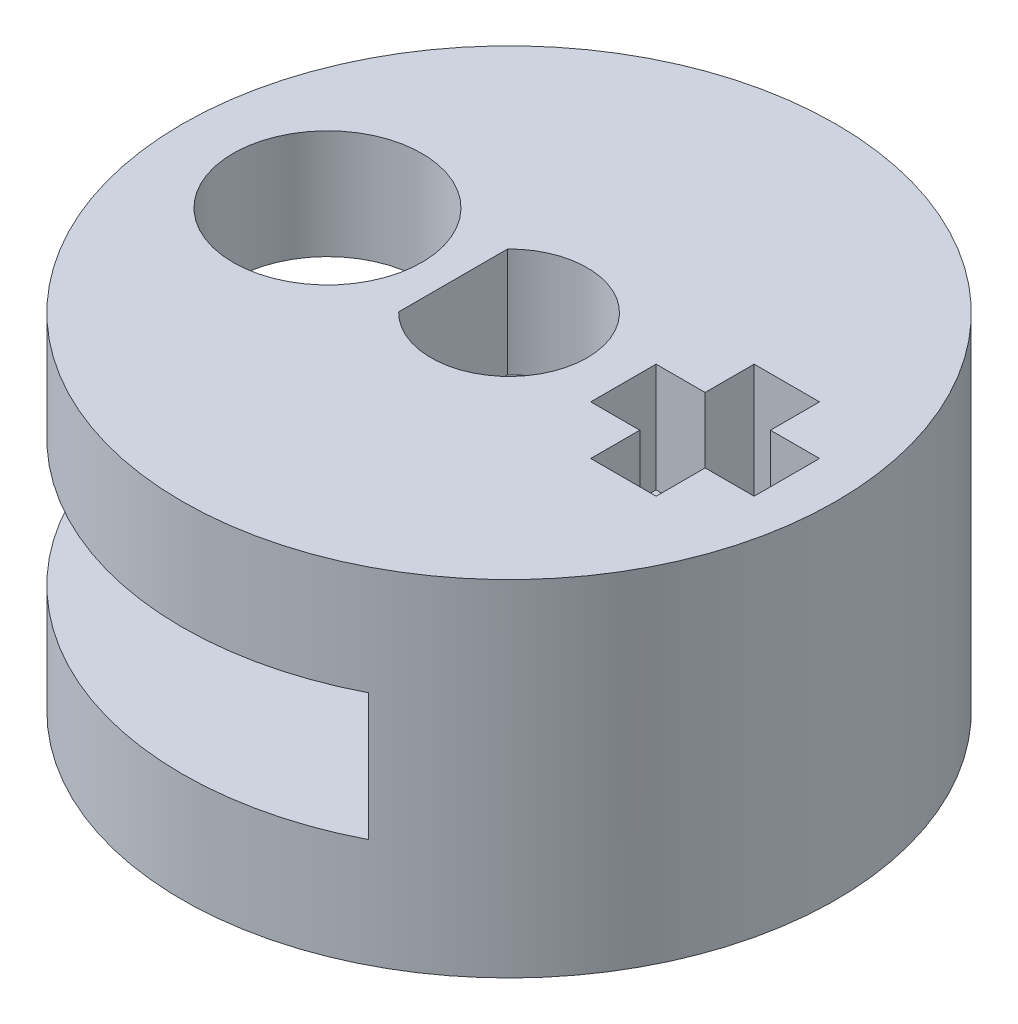
ISO-10303-21;
HEADER;
FILE_DESCRIPTION(('STEP AP214'),'2;1');
FILE_NAME('part.step','',(''),(''),'','','');
FILE_SCHEMA(('AUTOMOTIVE_DESIGN { 1 0 10303 214 1 1 1 1 }'));
ENDSEC;
DATA;
#1=APPLICATION_CONTEXT('core data for automotive mechanical design processes');
#2=APPLICATION_PROTOCOL_DEFINITION('international standard','automotive_design',2000,#1);
#3=PRODUCT_CONTEXT('',#1,'mechanical');
#4=PRODUCT('Part','Part','',(#3));
#5=PRODUCT_RELATED_PRODUCT_CATEGORY('part','',(#4));
#6=PRODUCT_DEFINITION_FORMATION('','',#4);
#7=PRODUCT_DEFINITION_CONTEXT('part definition',#1,'design');
#8=PRODUCT_DEFINITION('design','',#6,#7);
#9=PRODUCT_DEFINITION_SHAPE('','',#8);
#10=(LENGTH_UNIT() NAMED_UNIT(*) SI_UNIT(.MILLI.,.METRE.));
#11=(NAMED_UNIT(*) PLANE_ANGLE_UNIT() SI_UNIT($,.RADIAN.));
#12=(NAMED_UNIT(*) SI_UNIT($,.STERADIAN.) SOLID_ANGLE_UNIT());
#13=UNCERTAINTY_MEASURE_WITH_UNIT(LENGTH_MEASURE(1.E-05),#10,'distance_accuracy_value','');
#14=(GEOMETRIC_REPRESENTATION_CONTEXT(3) GLOBAL_UNCERTAINTY_ASSIGNED_CONTEXT((#13)) GLOBAL_UNIT_ASSIGNED_CONTEXT((#10,
#11,#12)) REPRESENTATION_CONTEXT('',''));
#15=CARTESIAN_POINT('',(0.,0.,0.));
#16=DIRECTION('',(0.,0.,1.));
#17=DIRECTION('',(1.,0.,0.));
#18=AXIS2_PLACEMENT_3D('',#15,#16,#17);
#19=CARTESIAN_POINT('',(4.12310562561766,-3.5,8.));
#20=DIRECTION('',(1.,0.,0.));
#21=DIRECTION('',(0.,0.,-1.));
#22=AXIS2_PLACEMENT_3D('',#19,#20,#21);
#23=PLANE('',#22);
#24=DIRECTION('',(0.,0.,-1.));
#25=VECTOR('',#24,1.);
#26=CARTESIAN_POINT('',(4.12310562561766,-3.5,8.));
#27=LINE('',#26,#25);
#28=CARTESIAN_POINT('',(4.12310562561766,-3.5,-0.798435283416333));
#29=VERTEX_POINT('',#28);
#30=CARTESIAN_POINT('',(4.12310562561766,-3.5,-8.));
#31=VERTEX_POINT('',#30);
#32=EDGE_CURVE('E329',#29,#31,#27,.T.);
#33=ORIENTED_EDGE('',*,*,#32,.F.);
#34=DIRECTION('',(0.,1.,0.));
#35=VECTOR('',#34,1.);
#36=CARTESIAN_POINT('',(4.12310562561766,-3.5,-0.798435283416334));
#37=LINE('',#36,#35);
#38=CARTESIAN_POINT('',(4.12310562561766,0.,-0.798435283416334));
#39=VERTEX_POINT('',#38);
#40=EDGE_CURVE('E299',#29,#39,#37,.T.);
#41=ORIENTED_EDGE('',*,*,#40,.T.);
#42=DIRECTION('',(0.,0.,-1.));
#43=VECTOR('',#42,1.);
#44=CARTESIAN_POINT('',(4.12310562561766,0.,8.));
#45=LINE('',#44,#43);
#46=CARTESIAN_POINT('',(4.12310562561766,0.,-8.));
#47=VERTEX_POINT('',#46);
#48=EDGE_CURVE('E320',#39,#47,#45,.T.);
#49=ORIENTED_EDGE('',*,*,#48,.T.);
#50=DIRECTION('',(0.,1.,0.));
#51=VECTOR('',#50,1.);
#52=CARTESIAN_POINT('',(4.12310562561766,-3.5,-8.));
#53=LINE('',#52,#51);
#54=EDGE_CURVE('E328',#31,#47,#53,.T.);
#55=ORIENTED_EDGE('',*,*,#54,.F.);
#56=EDGE_LOOP('',(#33,#41,#49,#55));
#57=FACE_BOUND('',#56,.T.);
#58=ADVANCED_FACE('F44',(#57),#23,.F.);
#59=CARTESIAN_POINT('',(0.,0.,0.));
#60=DIRECTION('',(0.,1.,0.));
#61=DIRECTION('',(0.,0.,1.));
#62=AXIS2_PLACEMENT_3D('',#59,#60,#61);
#63=PLANE('',#62);
#64=ORIENTED_EDGE('',*,*,#48,.F.);
#65=DIRECTION('',(-1.,0.,0.));
#66=VECTOR('',#65,1.);
#67=CARTESIAN_POINT('',(0.,0.,-0.798435283416332));
#68=LINE('',#67,#66);
#69=CARTESIAN_POINT('',(3.25,0.,-0.798435283416333));
#70=VERTEX_POINT('',#69);
#71=EDGE_CURVE('E303',#39,#70,#68,.T.);
#72=ORIENTED_EDGE('',*,*,#71,.T.);
#73=DIRECTION('',(0.,0.,1.));
#74=VECTOR('',#73,1.);
#75=CARTESIAN_POINT('',(3.25,0.,0.));
#76=LINE('',#75,#74);
#77=CARTESIAN_POINT('',(3.25,0.,1.00156471658367));
#78=VERTEX_POINT('',#77);
#79=EDGE_CURVE('E282',#70,#78,#76,.T.);
#80=ORIENTED_EDGE('',*,*,#79,.T.);
#81=DIRECTION('',(1.,0.,0.));
#82=VECTOR('',#81,1.);
#83=CARTESIAN_POINT('',(0.,0.,1.00156471658367));
#84=LINE('',#83,#82);
#85=CARTESIAN_POINT('',(4.12310562561766,0.,1.00156471658367));
#86=VERTEX_POINT('',#85);
#87=EDGE_CURVE('E190',#78,#86,#84,.T.);
#88=ORIENTED_EDGE('',*,*,#87,.T.);
#89=CARTESIAN_POINT('',(4.12310562561766,0.,8.));
#90=VERTEX_POINT('',#89);
#91=EDGE_CURVE('E330',#90,#86,#45,.T.);
#92=ORIENTED_EDGE('',*,*,#91,.F.);
#93=CARTESIAN_POINT('',(0.,0.,0.));
#94=DIRECTION('',(0.,1.,0.));
#95=DIRECTION('',(0.,0.,1.));
#96=AXIS2_PLACEMENT_3D('',#93,#94,#95);
#97=CIRCLE('',#96,9.);
#98=EDGE_CURVE('E369',#47,#90,#97,.T.);
#99=ORIENTED_EDGE('',*,*,#98,.F.);
#100=EDGE_LOOP('',(#64,#72,#80,#88,#92,#99));
#101=FACE_BOUND('',#100,.T.);
#102=CARTESIAN_POINT('',(0.,0.,0.));
#103=DIRECTION('',(0.,1.,0.));
#104=DIRECTION('',(0.,0.,1.));
#105=AXIS2_PLACEMENT_3D('',#102,#103,#104);
#106=CIRCLE('',#105,2.15);
#107=CARTESIAN_POINT('',(-1.54029218007494,0.,1.5));
#108=VERTEX_POINT('',#107);
#109=CARTESIAN_POINT('',(-1.54029218007494,0.,-1.5));
#110=VERTEX_POINT('',#109);
#111=EDGE_CURVE('E341',#108,#110,#106,.T.);
#112=ORIENTED_EDGE('',*,*,#111,.T.);
#113=DIRECTION('',(0.,0.,1.));
#114=VECTOR('',#113,1.);
#115=CARTESIAN_POINT('',(-1.54029218007494,0.,-1.5));
#116=LINE('',#115,#114);
#117=EDGE_CURVE('E347',#110,#108,#116,.T.);
#118=ORIENTED_EDGE('',*,*,#117,.T.);
#119=EDGE_LOOP('',(#112,#118));
#120=FACE_BOUND('',#119,.T.);
#121=CARTESIAN_POINT('',(-5.,0.,0.));
#122=DIRECTION('',(0.,1.,0.));
#123=DIRECTION('',(0.,0.,1.));
#124=AXIS2_PLACEMENT_3D('',#121,#122,#123);
#125=CIRCLE('',#124,2.6);
#126=CARTESIAN_POINT('',(-5.,0.,2.6));
#127=VERTEX_POINT('',#126);
#128=EDGE_CURVE('E364',#127,#127,#125,.T.);
#129=ORIENTED_EDGE('',*,*,#128,.T.);
#130=EDGE_LOOP('',(#129));
#131=FACE_BOUND('',#130,.T.);
#132=ADVANCED_FACE('F482',(#101,#120,#131),#63,.F.);
#133=CARTESIAN_POINT('',(0.,3.,0.));
#134=DIRECTION('',(0.,1.,0.));
#135=DIRECTION('',(0.,0.,1.));
#136=AXIS2_PLACEMENT_3D('',#133,#134,#135);
#137=PLANE('',#136);
#138=DIRECTION('',(-1.,0.,0.));
#139=VECTOR('',#138,1.);
#140=CARTESIAN_POINT('',(4.6,3.,-0.798435283416333));
#141=LINE('',#140,#139);
#142=CARTESIAN_POINT('',(4.6,3.,-0.798435283416333));
#143=VERTEX_POINT('',#142);
#144=CARTESIAN_POINT('',(3.25,3.,-0.798435283416333));
#145=VERTEX_POINT('',#144);
#146=EDGE_CURVE('E60',#143,#145,#141,.T.);
#147=ORIENTED_EDGE('',*,*,#146,.F.);
#148=DIRECTION('',(0.,0.,1.));
#149=VECTOR('',#148,1.);
#150=CARTESIAN_POINT('',(4.6,3.,-2.14843528341633));
#151=LINE('',#150,#149);
#152=CARTESIAN_POINT('',(4.6,3.,-2.14843528341633));
#153=VERTEX_POINT('',#152);
#154=EDGE_CURVE('E242',#153,#143,#151,.T.);
#155=ORIENTED_EDGE('',*,*,#154,.F.);
#156=DIRECTION('',(-1.,0.,0.));
#157=VECTOR('',#156,1.);
#158=CARTESIAN_POINT('',(6.4,3.,-2.14843528341633));
#159=LINE('',#158,#157);
#160=CARTESIAN_POINT('',(6.4,3.,-2.14843528341633));
#161=VERTEX_POINT('',#160);
#162=EDGE_CURVE('E238',#161,#153,#159,.T.);
#163=ORIENTED_EDGE('',*,*,#162,.F.);
#164=DIRECTION('',(0.,0.,-1.));
#165=VECTOR('',#164,1.);
#166=CARTESIAN_POINT('',(6.4,3.,-0.798435283416333));
#167=LINE('',#166,#165);
#168=CARTESIAN_POINT('',(6.4,3.,-0.798435283416333));
#169=VERTEX_POINT('',#168);
#170=EDGE_CURVE('E234',#169,#161,#167,.T.);
#171=ORIENTED_EDGE('',*,*,#170,.F.);
#172=DIRECTION('',(-1.,0.,0.));
#173=VECTOR('',#172,1.);
#174=CARTESIAN_POINT('',(7.75,3.,-0.798435283416334));
#175=LINE('',#174,#173);
#176=CARTESIAN_POINT('',(7.75,3.,-0.798435283416334));
#177=VERTEX_POINT('',#176);
#178=EDGE_CURVE('E230',#177,#169,#175,.T.);
#179=ORIENTED_EDGE('',*,*,#178,.F.);
#180=DIRECTION('',(0.,0.,-1.));
#181=VECTOR('',#180,1.);
#182=CARTESIAN_POINT('',(7.75,3.,1.00156471658367));
#183=LINE('',#182,#181);
#184=CARTESIAN_POINT('',(7.75,3.,1.00156471658367));
#185=VERTEX_POINT('',#184);
#186=EDGE_CURVE('E226',#185,#177,#183,.T.);
#187=ORIENTED_EDGE('',*,*,#186,.F.);
#188=DIRECTION('',(1.,0.,0.));
#189=VECTOR('',#188,1.);
#190=CARTESIAN_POINT('',(6.4,3.,1.00156471658367));
#191=LINE('',#190,#189);
#192=CARTESIAN_POINT('',(6.4,3.,1.00156471658367));
#193=VERTEX_POINT('',#192);
#194=EDGE_CURVE('E222',#193,#185,#191,.T.);
#195=ORIENTED_EDGE('',*,*,#194,.F.);
#196=DIRECTION('',(0.,0.,-1.));
#197=VECTOR('',#196,1.);
#198=CARTESIAN_POINT('',(6.4,3.,2.35156471658367));
#199=LINE('',#198,#197);
#200=CARTESIAN_POINT('',(6.4,3.,2.35156471658367));
#201=VERTEX_POINT('',#200);
#202=EDGE_CURVE('E218',#201,#193,#199,.T.);
#203=ORIENTED_EDGE('',*,*,#202,.F.);
#204=DIRECTION('',(1.,0.,0.));
#205=VECTOR('',#204,1.);
#206=CARTESIAN_POINT('',(4.6,3.,2.35156471658367));
#207=LINE('',#206,#205);
#208=CARTESIAN_POINT('',(4.6,3.,2.35156471658367));
#209=VERTEX_POINT('',#208);
#210=EDGE_CURVE('E211',#209,#201,#207,.T.);
#211=ORIENTED_EDGE('',*,*,#210,.F.);
#212=DIRECTION('',(0.,0.,1.));
#213=VECTOR('',#212,1.);
#214=CARTESIAN_POINT('',(4.6,3.,1.00156471658367));
#215=LINE('',#214,#213);
#216=CARTESIAN_POINT('',(4.6,3.,1.00156471658367));
#217=VERTEX_POINT('',#216);
#218=EDGE_CURVE('E207',#217,#209,#215,.T.);
#219=ORIENTED_EDGE('',*,*,#218,.F.);
#220=DIRECTION('',(1.,0.,0.));
#221=VECTOR('',#220,1.);
#222=CARTESIAN_POINT('',(3.25,3.,1.00156471658367));
#223=LINE('',#222,#221);
#224=CARTESIAN_POINT('',(3.25,3.,1.00156471658367));
#225=VERTEX_POINT('',#224);
#226=EDGE_CURVE('E187',#225,#217,#223,.T.);
#227=ORIENTED_EDGE('',*,*,#226,.F.);
#228=DIRECTION('',(0.,0.,1.));
#229=VECTOR('',#228,1.);
#230=CARTESIAN_POINT('',(3.25,3.,-0.798435283416333));
#231=LINE('',#230,#229);
#232=EDGE_CURVE('E197',#145,#225,#231,.T.);
#233=ORIENTED_EDGE('',*,*,#232,.F.);
#234=EDGE_LOOP('',(#147,#155,#163,#171,#179,#187,#195,#203,#211,#219,#227,#233));
#235=FACE_BOUND('',#234,.T.);
#236=CARTESIAN_POINT('',(0.,3.,0.));
#237=DIRECTION('',(0.,1.,0.));
#238=DIRECTION('',(0.,0.,1.));
#239=AXIS2_PLACEMENT_3D('',#236,#237,#238);
#240=CIRCLE('',#239,9.);
#241=CARTESIAN_POINT('',(0.,3.,9.));
#242=VERTEX_POINT('',#241);
#243=EDGE_CURVE('E373',#242,#242,#240,.T.);
#244=ORIENTED_EDGE('',*,*,#243,.T.);
#245=EDGE_LOOP('',(#244));
#246=FACE_BOUND('',#245,.T.);
#247=CARTESIAN_POINT('',(-5.,3.,0.));
#248=DIRECTION('',(0.,1.,0.));
#249=DIRECTION('',(0.,0.,1.));
#250=AXIS2_PLACEMENT_3D('',#247,#248,#249);
#251=CIRCLE('',#250,2.6);
#252=CARTESIAN_POINT('',(-5.,3.,2.6));
#253=VERTEX_POINT('',#252);
#254=EDGE_CURVE('E365',#253,#253,#251,.T.);
#255=ORIENTED_EDGE('',*,*,#254,.F.);
#256=EDGE_LOOP('',(#255));
#257=FACE_BOUND('',#256,.T.);
#258=DIRECTION('',(0.,0.,1.));
#259=VECTOR('',#258,1.);
#260=CARTESIAN_POINT('',(-1.54029218007494,3.,-1.5));
#261=LINE('',#260,#259);
#262=CARTESIAN_POINT('',(-1.54029218007494,3.,-1.5));
#263=VERTEX_POINT('',#262);
#264=CARTESIAN_POINT('',(-1.54029218007494,3.,1.5));
#265=VERTEX_POINT('',#264);
#266=EDGE_CURVE('E346',#263,#265,#261,.T.);
#267=ORIENTED_EDGE('',*,*,#266,.F.);
#268=CARTESIAN_POINT('',(0.,3.,0.));
#269=DIRECTION('',(0.,1.,0.));
#270=DIRECTION('',(0.,0.,1.));
#271=AXIS2_PLACEMENT_3D('',#268,#269,#270);
#272=CIRCLE('',#271,2.15);
#273=EDGE_CURVE('E342',#265,#263,#272,.T.);
#274=ORIENTED_EDGE('',*,*,#273,.F.);
#275=EDGE_LOOP('',(#267,#274));
#276=FACE_BOUND('',#275,.T.);
#277=ADVANCED_FACE('F203',(#235,#246,#257,#276),#137,.T.);
#278=CARTESIAN_POINT('',(0.,3.,0.));
#279=DIRECTION('',(0.,-1.,0.));
#280=DIRECTION('',(0.,0.,-1.));
#281=AXIS2_PLACEMENT_3D('',#278,#279,#280);
#282=CYLINDRICAL_SURFACE('',#281,9.);
#283=ORIENTED_EDGE('',*,*,#243,.F.);
#284=EDGE_LOOP('',(#283));
#285=FACE_BOUND('',#284,.T.);
#286=ORIENTED_EDGE('',*,*,#98,.T.);
#287=DIRECTION('',(0.,1.,0.));
#288=VECTOR('',#287,1.);
#289=CARTESIAN_POINT('',(4.12310562561766,-3.5,8.));
#290=LINE('',#289,#288);
#291=CARTESIAN_POINT('',(4.12310562561766,-3.5,8.));
#292=VERTEX_POINT('',#291);
#293=EDGE_CURVE('E337',#292,#90,#290,.T.);
#294=ORIENTED_EDGE('',*,*,#293,.F.);
#295=CARTESIAN_POINT('',(0.,-3.5,0.));
#296=DIRECTION('',(0.,-1.,0.));
#297=DIRECTION('',(0.,0.,-1.));
#298=AXIS2_PLACEMENT_3D('',#295,#296,#297);
#299=CIRCLE('',#298,9.);
#300=EDGE_CURVE('E312',#292,#31,#299,.T.);
#301=ORIENTED_EDGE('',*,*,#300,.T.);
#302=ORIENTED_EDGE('',*,*,#54,.T.);
#303=EDGE_LOOP('',(#286,#294,#301,#302));
#304=FACE_BOUND('',#303,.T.);
#305=CARTESIAN_POINT('',(0.,-6.5,0.));
#306=DIRECTION('',(0.,-1.,0.));
#307=DIRECTION('',(0.,0.,-1.));
#308=AXIS2_PLACEMENT_3D('',#305,#306,#307);
#309=CIRCLE('',#308,9.);
#310=CARTESIAN_POINT('',(0.,-6.5,-9.));
#311=VERTEX_POINT('',#310);
#312=EDGE_CURVE('E316',#311,#311,#309,.T.);
#313=ORIENTED_EDGE('',*,*,#312,.F.);
#314=EDGE_LOOP('',(#313));
#315=FACE_BOUND('',#314,.T.);
#316=ADVANCED_FACE('F46',(#285,#304,#315),#282,.T.);
#317=CARTESIAN_POINT('',(-5.,3.,0.));
#318=DIRECTION('',(0.,-1.,0.));
#319=DIRECTION('',(0.,0.,-1.));
#320=AXIS2_PLACEMENT_3D('',#317,#318,#319);
#321=CYLINDRICAL_SURFACE('',#320,2.6);
#322=ORIENTED_EDGE('',*,*,#254,.T.);
#323=EDGE_LOOP('',(#322));
#324=FACE_BOUND('',#323,.T.);
#325=ORIENTED_EDGE('',*,*,#128,.F.);
#326=EDGE_LOOP('',(#325));
#327=FACE_BOUND('',#326,.T.);
#328=ADVANCED_FACE('F488',(#324,#327),#321,.F.);
#329=CARTESIAN_POINT('',(0.,3.,0.));
#330=DIRECTION('',(0.,-1.,0.));
#331=DIRECTION('',(0.,0.,-1.));
#332=AXIS2_PLACEMENT_3D('',#329,#330,#331);
#333=CYLINDRICAL_SURFACE('',#332,2.15);
#334=ORIENTED_EDGE('',*,*,#111,.F.);
#335=DIRECTION('',(0.,-1.,0.));
#336=VECTOR('',#335,1.);
#337=CARTESIAN_POINT('',(-1.54029218007494,3.,1.5));
#338=LINE('',#337,#336);
#339=EDGE_CURVE('E350',#265,#108,#338,.T.);
#340=ORIENTED_EDGE('',*,*,#339,.F.);
#341=ORIENTED_EDGE('',*,*,#273,.T.);
#342=DIRECTION('',(0.,-1.,0.));
#343=VECTOR('',#342,1.);
#344=CARTESIAN_POINT('',(-1.54029218007494,3.,-1.5));
#345=LINE('',#344,#343);
#346=EDGE_CURVE('E360',#263,#110,#345,.T.);
#347=ORIENTED_EDGE('',*,*,#346,.T.);
#348=EDGE_LOOP('',(#334,#340,#341,#347));
#349=FACE_BOUND('',#348,.T.);
#350=ADVANCED_FACE('F490',(#349),#333,.F.);
#351=CARTESIAN_POINT('',(-1.54029218007494,3.,-1.5));
#352=DIRECTION('',(1.,0.,0.));
#353=DIRECTION('',(0.,0.,-1.));
#354=AXIS2_PLACEMENT_3D('',#351,#352,#353);
#355=PLANE('',#354);
#356=ORIENTED_EDGE('',*,*,#117,.F.);
#357=ORIENTED_EDGE('',*,*,#346,.F.);
#358=ORIENTED_EDGE('',*,*,#266,.T.);
#359=ORIENTED_EDGE('',*,*,#339,.T.);
#360=EDGE_LOOP('',(#356,#357,#358,#359));
#361=FACE_BOUND('',#360,.T.);
#362=ADVANCED_FACE('F496',(#361),#355,.T.);
#363=ORIENTED_EDGE('',*,*,#91,.T.);
#364=DIRECTION('',(0.,-1.,0.));
#365=VECTOR('',#364,1.);
#366=CARTESIAN_POINT('',(4.12310562561766,-3.5,1.00156471658367));
#367=LINE('',#366,#365);
#368=CARTESIAN_POINT('',(4.12310562561766,-3.5,1.00156471658367));
#369=VERTEX_POINT('',#368);
#370=EDGE_CURVE('E289',#86,#369,#367,.T.);
#371=ORIENTED_EDGE('',*,*,#370,.T.);
#372=EDGE_CURVE('E324',#292,#369,#27,.T.);
#373=ORIENTED_EDGE('',*,*,#372,.F.);
#374=ORIENTED_EDGE('',*,*,#293,.T.);
#375=EDGE_LOOP('',(#363,#371,#373,#374));
#376=FACE_BOUND('',#375,.T.);
#377=ADVANCED_FACE('F480',(#376),#23,.F.);
#378=CARTESIAN_POINT('',(0.,-3.5,0.));
#379=DIRECTION('',(0.,-1.,0.));
#380=DIRECTION('',(0.,0.,-1.));
#381=AXIS2_PLACEMENT_3D('',#378,#379,#380);
#382=PLANE('',#381);
#383=CARTESIAN_POINT('',(-5.,-3.5,0.));
#384=DIRECTION('',(0.,-1.,0.));
#385=DIRECTION('',(0.,0.,-1.));
#386=AXIS2_PLACEMENT_3D('',#383,#384,#385);
#387=CIRCLE('',#386,2.6);
#388=CARTESIAN_POINT('',(-5.,-3.5,-2.6));
#389=VERTEX_POINT('',#388);
#390=EDGE_CURVE('E307',#389,#389,#387,.T.);
#391=ORIENTED_EDGE('',*,*,#390,.T.);
#392=EDGE_LOOP('',(#391));
#393=FACE_BOUND('',#392,.T.);
#394=DIRECTION('',(0.,0.,-1.));
#395=VECTOR('',#394,1.);
#396=CARTESIAN_POINT('',(3.25,-3.5,0.));
#397=LINE('',#396,#395);
#398=CARTESIAN_POINT('',(3.25,-3.5,1.00156471658367));
#399=VERTEX_POINT('',#398);
#400=CARTESIAN_POINT('',(3.25,-3.5,-0.798435283416333));
#401=VERTEX_POINT('',#400);
#402=EDGE_CURVE('E249',#399,#401,#397,.T.);
#403=ORIENTED_EDGE('',*,*,#402,.T.);
#404=DIRECTION('',(1.,0.,0.));
#405=VECTOR('',#404,1.);
#406=CARTESIAN_POINT('',(0.,-3.5,-0.798435283416332));
#407=LINE('',#406,#405);
#408=EDGE_CURVE('E295',#401,#29,#407,.T.);
#409=ORIENTED_EDGE('',*,*,#408,.T.);
#410=ORIENTED_EDGE('',*,*,#32,.T.);
#411=ORIENTED_EDGE('',*,*,#300,.F.);
#412=ORIENTED_EDGE('',*,*,#372,.T.);
#413=DIRECTION('',(-1.,0.,0.));
#414=VECTOR('',#413,1.);
#415=CARTESIAN_POINT('',(0.,-3.5,1.00156471658367));
#416=LINE('',#415,#414);
#417=EDGE_CURVE('E285',#369,#399,#416,.T.);
#418=ORIENTED_EDGE('',*,*,#417,.T.);
#419=EDGE_LOOP('',(#403,#409,#410,#411,#412,#418));
#420=FACE_BOUND('',#419,.T.);
#421=ADVANCED_FACE('F472',(#393,#420),#382,.F.);
#422=CARTESIAN_POINT('',(0.,-6.5,0.));
#423=DIRECTION('',(0.,-1.,0.));
#424=DIRECTION('',(0.,0.,-1.));
#425=AXIS2_PLACEMENT_3D('',#422,#423,#424);
#426=PLANE('',#425);
#427=DIRECTION('',(1.,0.,0.));
#428=VECTOR('',#427,1.);
#429=CARTESIAN_POINT('',(0.,-6.5,-0.798435283416332));
#430=LINE('',#429,#428);
#431=CARTESIAN_POINT('',(3.25,-6.5,-0.798435283416333));
#432=VERTEX_POINT('',#431);
#433=CARTESIAN_POINT('',(4.6,-6.5,-0.798435283416333));
#434=VERTEX_POINT('',#433);
#435=EDGE_CURVE('E11',#432,#434,#430,.T.);
#436=ORIENTED_EDGE('',*,*,#435,.F.);
#437=DIRECTION('',(0.,0.,-1.));
#438=VECTOR('',#437,1.);
#439=CARTESIAN_POINT('',(3.25,-6.5,0.));
#440=LINE('',#439,#438);
#441=CARTESIAN_POINT('',(3.25,-6.5,1.00156471658367));
#442=VERTEX_POINT('',#441);
#443=EDGE_CURVE('E377',#442,#432,#440,.T.);
#444=ORIENTED_EDGE('',*,*,#443,.F.);
#445=DIRECTION('',(-1.,0.,0.));
#446=VECTOR('',#445,1.);
#447=CARTESIAN_POINT('',(0.,-6.5,1.00156471658367));
#448=LINE('',#447,#446);
#449=CARTESIAN_POINT('',(4.6,-6.5,1.00156471658367));
#450=VERTEX_POINT('',#449);
#451=EDGE_CURVE('E383',#450,#442,#448,.T.);
#452=ORIENTED_EDGE('',*,*,#451,.F.);
#453=DIRECTION('',(0.,0.,-1.));
#454=VECTOR('',#453,1.);
#455=CARTESIAN_POINT('',(4.6,-6.5,0.));
#456=LINE('',#455,#454);
#457=CARTESIAN_POINT('',(4.6,-6.5,2.35156471658367));
#458=VERTEX_POINT('',#457);
#459=EDGE_CURVE('E387',#458,#450,#456,.T.);
#460=ORIENTED_EDGE('',*,*,#459,.F.);
#461=DIRECTION('',(-1.,0.,0.));
#462=VECTOR('',#461,1.);
#463=CARTESIAN_POINT('',(0.,-6.5,2.35156471658367));
#464=LINE('',#463,#462);
#465=CARTESIAN_POINT('',(6.4,-6.5,2.35156471658367));
#466=VERTEX_POINT('',#465);
#467=EDGE_CURVE('E390',#466,#458,#464,.T.);
#468=ORIENTED_EDGE('',*,*,#467,.F.);
#469=DIRECTION('',(0.,0.,1.));
#470=VECTOR('',#469,1.);
#471=CARTESIAN_POINT('',(6.4,-6.5,0.));
#472=LINE('',#471,#470);
#473=CARTESIAN_POINT('',(6.4,-6.5,1.00156471658367));
#474=VERTEX_POINT('',#473);
#475=EDGE_CURVE('E393',#474,#466,#472,.T.);
#476=ORIENTED_EDGE('',*,*,#475,.F.);
#477=DIRECTION('',(-1.,0.,0.));
#478=VECTOR('',#477,1.);
#479=CARTESIAN_POINT('',(0.,-6.5,1.00156471658367));
#480=LINE('',#479,#478);
#481=CARTESIAN_POINT('',(7.75,-6.5,1.00156471658367));
#482=VERTEX_POINT('',#481);
#483=EDGE_CURVE('E396',#482,#474,#480,.T.);
#484=ORIENTED_EDGE('',*,*,#483,.F.);
#485=DIRECTION('',(0.,0.,1.));
#486=VECTOR('',#485,1.);
#487=CARTESIAN_POINT('',(7.75,-6.5,0.));
#488=LINE('',#487,#486);
#489=CARTESIAN_POINT('',(7.75,-6.5,-0.798435283416334));
#490=VERTEX_POINT('',#489);
#491=EDGE_CURVE('E399',#490,#482,#488,.T.);
#492=ORIENTED_EDGE('',*,*,#491,.F.);
#493=DIRECTION('',(1.,0.,0.));
#494=VECTOR('',#493,1.);
#495=CARTESIAN_POINT('',(0.,-6.5,-0.798435283416332));
#496=LINE('',#495,#494);
#497=CARTESIAN_POINT('',(6.4,-6.5,-0.798435283416333));
#498=VERTEX_POINT('',#497);
#499=EDGE_CURVE('E402',#498,#490,#496,.T.);
#500=ORIENTED_EDGE('',*,*,#499,.F.);
#501=DIRECTION('',(0.,0.,1.));
#502=VECTOR('',#501,1.);
#503=CARTESIAN_POINT('',(6.4,-6.5,0.));
#504=LINE('',#503,#502);
#505=CARTESIAN_POINT('',(6.4,-6.5,-2.14843528341633));
#506=VERTEX_POINT('',#505);
#507=EDGE_CURVE('E405',#506,#498,#504,.T.);
#508=ORIENTED_EDGE('',*,*,#507,.F.);
#509=DIRECTION('',(1.,0.,0.));
#510=VECTOR('',#509,1.);
#511=CARTESIAN_POINT('',(0.,-6.5,-2.14843528341633));
#512=LINE('',#511,#510);
#513=CARTESIAN_POINT('',(4.6,-6.5,-2.14843528341633));
#514=VERTEX_POINT('',#513);
#515=EDGE_CURVE('E408',#514,#506,#512,.T.);
#516=ORIENTED_EDGE('',*,*,#515,.F.);
#517=DIRECTION('',(0.,0.,-1.));
#518=VECTOR('',#517,1.);
#519=CARTESIAN_POINT('',(4.6,-6.5,0.));
#520=LINE('',#519,#518);
#521=EDGE_CURVE('E53',#434,#514,#520,.T.);
#522=ORIENTED_EDGE('',*,*,#521,.F.);
#523=EDGE_LOOP('',(#436,#444,#452,#460,#468,#476,#484,#492,#500,#508,#516,#522));
#524=FACE_BOUND('',#523,.T.);
#525=ORIENTED_EDGE('',*,*,#312,.T.);
#526=EDGE_LOOP('',(#525));
#527=FACE_BOUND('',#526,.T.);
#528=CARTESIAN_POINT('',(-5.,-6.5,0.));
#529=DIRECTION('',(0.,-1.,0.));
#530=DIRECTION('',(0.,0.,-1.));
#531=AXIS2_PLACEMENT_3D('',#528,#529,#530);
#532=CIRCLE('',#531,2.6);
#533=CARTESIAN_POINT('',(-5.,-6.5,-2.6));
#534=VERTEX_POINT('',#533);
#535=EDGE_CURVE('E308',#534,#534,#532,.T.);
#536=ORIENTED_EDGE('',*,*,#535,.F.);
#537=EDGE_LOOP('',(#536));
#538=FACE_BOUND('',#537,.T.);
#539=ADVANCED_FACE('F425',(#524,#527,#538),#426,.T.);
#540=CARTESIAN_POINT('',(-5.,-6.5,0.));
#541=DIRECTION('',(0.,1.,0.));
#542=DIRECTION('',(0.,0.,1.));
#543=AXIS2_PLACEMENT_3D('',#540,#541,#542);
#544=CYLINDRICAL_SURFACE('',#543,2.6);
#545=ORIENTED_EDGE('',*,*,#535,.T.);
#546=EDGE_LOOP('',(#545));
#547=FACE_BOUND('',#546,.T.);
#548=ORIENTED_EDGE('',*,*,#390,.F.);
#549=EDGE_LOOP('',(#548));
#550=FACE_BOUND('',#549,.T.);
#551=ADVANCED_FACE('F555',(#547,#550),#544,.F.);
#552=CARTESIAN_POINT('',(4.6,-7.,-0.798435283416333));
#553=DIRECTION('',(0.,0.,-1.));
#554=DIRECTION('',(-1.,0.,0.));
#555=AXIS2_PLACEMENT_3D('',#552,#553,#554);
#556=PLANE('',#555);
#557=ORIENTED_EDGE('',*,*,#40,.F.);
#558=ORIENTED_EDGE('',*,*,#408,.F.);
#559=DIRECTION('',(0.,1.,0.));
#560=VECTOR('',#559,1.);
#561=CARTESIAN_POINT('',(3.25,-7.,-0.798435283416333));
#562=LINE('',#561,#560);
#563=EDGE_CURVE('E68',#432,#401,#562,.T.);
#564=ORIENTED_EDGE('',*,*,#563,.F.);
#565=ORIENTED_EDGE('',*,*,#435,.T.);
#566=DIRECTION('',(0.,1.,0.));
#567=VECTOR('',#566,1.);
#568=CARTESIAN_POINT('',(4.6,-7.,-0.798435283416333));
#569=LINE('',#568,#567);
#570=EDGE_CURVE('E246',#434,#143,#569,.T.);
#571=ORIENTED_EDGE('',*,*,#570,.T.);
#572=ORIENTED_EDGE('',*,*,#146,.T.);
#573=EDGE_CURVE('E199',#70,#145,#562,.T.);
#574=ORIENTED_EDGE('',*,*,#573,.F.);
#575=ORIENTED_EDGE('',*,*,#71,.F.);
#576=EDGE_LOOP('',(#557,#558,#564,#565,#571,#572,#574,#575));
#577=FACE_BOUND('',#576,.T.);
#578=ADVANCED_FACE('F463',(#577),#556,.F.);
#579=CARTESIAN_POINT('',(3.25,-7.,1.00156471658367));
#580=DIRECTION('',(0.,0.,1.));
#581=DIRECTION('',(1.,0.,0.));
#582=AXIS2_PLACEMENT_3D('',#579,#580,#581);
#583=PLANE('',#582);
#584=DIRECTION('',(0.,1.,0.));
#585=VECTOR('',#584,1.);
#586=CARTESIAN_POINT('',(3.25,-7.,1.00156471658367));
#587=LINE('',#586,#585);
#588=EDGE_CURVE('E182',#78,#225,#587,.T.);
#589=ORIENTED_EDGE('',*,*,#588,.T.);
#590=ORIENTED_EDGE('',*,*,#226,.T.);
#591=DIRECTION('',(0.,1.,0.));
#592=VECTOR('',#591,1.);
#593=CARTESIAN_POINT('',(4.6,-7.,1.00156471658367));
#594=LINE('',#593,#592);
#595=EDGE_CURVE('E274',#450,#217,#594,.T.);
#596=ORIENTED_EDGE('',*,*,#595,.F.);
#597=ORIENTED_EDGE('',*,*,#451,.T.);
#598=EDGE_CURVE('E194',#442,#399,#587,.T.);
#599=ORIENTED_EDGE('',*,*,#598,.T.);
#600=ORIENTED_EDGE('',*,*,#417,.F.);
#601=ORIENTED_EDGE('',*,*,#370,.F.);
#602=ORIENTED_EDGE('',*,*,#87,.F.);
#603=EDGE_LOOP('',(#589,#590,#596,#597,#599,#600,#601,#602));
#604=FACE_BOUND('',#603,.T.);
#605=ADVANCED_FACE('F184',(#604),#583,.F.);
#606=CARTESIAN_POINT('',(3.25,-7.,-0.798435283416333));
#607=DIRECTION('',(-1.,0.,0.));
#608=DIRECTION('',(0.,0.,1.));
#609=AXIS2_PLACEMENT_3D('',#606,#607,#608);
#610=PLANE('',#609);
#611=ORIENTED_EDGE('',*,*,#573,.T.);
#612=ORIENTED_EDGE('',*,*,#232,.T.);
#613=ORIENTED_EDGE('',*,*,#588,.F.);
#614=ORIENTED_EDGE('',*,*,#79,.F.);
#615=EDGE_LOOP('',(#611,#612,#613,#614));
#616=FACE_BOUND('',#615,.T.);
#617=ADVANCED_FACE('F198',(#616),#610,.F.);
#618=ORIENTED_EDGE('',*,*,#598,.F.);
#619=ORIENTED_EDGE('',*,*,#443,.T.);
#620=ORIENTED_EDGE('',*,*,#563,.T.);
#621=ORIENTED_EDGE('',*,*,#402,.F.);
#622=EDGE_LOOP('',(#618,#619,#620,#621));
#623=FACE_BOUND('',#622,.T.);
#624=ADVANCED_FACE('F462',(#623),#610,.F.);
#625=CARTESIAN_POINT('',(4.6,-7.,-2.14843528341633));
#626=DIRECTION('',(-1.,0.,0.));
#627=DIRECTION('',(0.,0.,1.));
#628=AXIS2_PLACEMENT_3D('',#625,#626,#627);
#629=PLANE('',#628);
#630=ORIENTED_EDGE('',*,*,#521,.T.);
#631=DIRECTION('',(0.,1.,0.));
#632=VECTOR('',#631,1.);
#633=CARTESIAN_POINT('',(4.6,-7.,-2.14843528341633));
#634=LINE('',#633,#632);
#635=EDGE_CURVE('E250',#514,#153,#634,.T.);
#636=ORIENTED_EDGE('',*,*,#635,.T.);
#637=ORIENTED_EDGE('',*,*,#154,.T.);
#638=ORIENTED_EDGE('',*,*,#570,.F.);
#639=EDGE_LOOP('',(#630,#636,#637,#638));
#640=FACE_BOUND('',#639,.T.);
#641=ADVANCED_FACE('F415',(#640),#629,.F.);
#642=CARTESIAN_POINT('',(6.4,-7.,-2.14843528341633));
#643=DIRECTION('',(0.,0.,-1.));
#644=DIRECTION('',(-1.,0.,0.));
#645=AXIS2_PLACEMENT_3D('',#642,#643,#644);
#646=PLANE('',#645);
#647=ORIENTED_EDGE('',*,*,#515,.T.);
#648=DIRECTION('',(0.,1.,0.));
#649=VECTOR('',#648,1.);
#650=CARTESIAN_POINT('',(6.4,-7.,-2.14843528341633));
#651=LINE('',#650,#649);
#652=EDGE_CURVE('E253',#506,#161,#651,.T.);
#653=ORIENTED_EDGE('',*,*,#652,.T.);
#654=ORIENTED_EDGE('',*,*,#162,.T.);
#655=ORIENTED_EDGE('',*,*,#635,.F.);
#656=EDGE_LOOP('',(#647,#653,#654,#655));
#657=FACE_BOUND('',#656,.T.);
#658=ADVANCED_FACE('F420',(#657),#646,.F.);
#659=CARTESIAN_POINT('',(6.4,-7.,-0.798435283416333));
#660=DIRECTION('',(1.,0.,0.));
#661=DIRECTION('',(0.,0.,-1.));
#662=AXIS2_PLACEMENT_3D('',#659,#660,#661);
#663=PLANE('',#662);
#664=ORIENTED_EDGE('',*,*,#507,.T.);
#665=DIRECTION('',(0.,1.,0.));
#666=VECTOR('',#665,1.);
#667=CARTESIAN_POINT('',(6.4,-7.,-0.798435283416333));
#668=LINE('',#667,#666);
#669=EDGE_CURVE('E256',#498,#169,#668,.T.);
#670=ORIENTED_EDGE('',*,*,#669,.T.);
#671=ORIENTED_EDGE('',*,*,#170,.T.);
#672=ORIENTED_EDGE('',*,*,#652,.F.);
#673=EDGE_LOOP('',(#664,#670,#671,#672));
#674=FACE_BOUND('',#673,.T.);
#675=ADVANCED_FACE('F431',(#674),#663,.F.);
#676=CARTESIAN_POINT('',(7.75,-7.,-0.798435283416334));
#677=DIRECTION('',(0.,0.,-1.));
#678=DIRECTION('',(-1.,0.,0.));
#679=AXIS2_PLACEMENT_3D('',#676,#677,#678);
#680=PLANE('',#679);
#681=ORIENTED_EDGE('',*,*,#499,.T.);
#682=DIRECTION('',(0.,1.,0.));
#683=VECTOR('',#682,1.);
#684=CARTESIAN_POINT('',(7.75,-7.,-0.798435283416334));
#685=LINE('',#684,#683);
#686=EDGE_CURVE('E259',#490,#177,#685,.T.);
#687=ORIENTED_EDGE('',*,*,#686,.T.);
#688=ORIENTED_EDGE('',*,*,#178,.T.);
#689=ORIENTED_EDGE('',*,*,#669,.F.);
#690=EDGE_LOOP('',(#681,#687,#688,#689));
#691=FACE_BOUND('',#690,.T.);
#692=ADVANCED_FACE('F433',(#691),#680,.F.);
#693=CARTESIAN_POINT('',(7.75,-7.,1.00156471658367));
#694=DIRECTION('',(1.,0.,0.));
#695=DIRECTION('',(0.,0.,-1.));
#696=AXIS2_PLACEMENT_3D('',#693,#694,#695);
#697=PLANE('',#696);
#698=ORIENTED_EDGE('',*,*,#491,.T.);
#699=DIRECTION('',(0.,1.,0.));
#700=VECTOR('',#699,1.);
#701=CARTESIAN_POINT('',(7.75,-7.,1.00156471658367));
#702=LINE('',#701,#700);
#703=EDGE_CURVE('E262',#482,#185,#702,.T.);
#704=ORIENTED_EDGE('',*,*,#703,.T.);
#705=ORIENTED_EDGE('',*,*,#186,.T.);
#706=ORIENTED_EDGE('',*,*,#686,.F.);
#707=EDGE_LOOP('',(#698,#704,#705,#706));
#708=FACE_BOUND('',#707,.T.);
#709=ADVANCED_FACE('F442',(#708),#697,.F.);
#710=CARTESIAN_POINT('',(6.4,-7.,1.00156471658367));
#711=DIRECTION('',(0.,0.,1.));
#712=DIRECTION('',(1.,0.,0.));
#713=AXIS2_PLACEMENT_3D('',#710,#711,#712);
#714=PLANE('',#713);
#715=ORIENTED_EDGE('',*,*,#483,.T.);
#716=DIRECTION('',(0.,1.,0.));
#717=VECTOR('',#716,1.);
#718=CARTESIAN_POINT('',(6.4,-7.,1.00156471658367));
#719=LINE('',#718,#717);
#720=EDGE_CURVE('E265',#474,#193,#719,.T.);
#721=ORIENTED_EDGE('',*,*,#720,.T.);
#722=ORIENTED_EDGE('',*,*,#194,.T.);
#723=ORIENTED_EDGE('',*,*,#703,.F.);
#724=EDGE_LOOP('',(#715,#721,#722,#723));
#725=FACE_BOUND('',#724,.T.);
#726=ADVANCED_FACE('F446',(#725),#714,.F.);
#727=CARTESIAN_POINT('',(6.4,-7.,2.35156471658367));
#728=DIRECTION('',(1.,0.,0.));
#729=DIRECTION('',(0.,0.,-1.));
#730=AXIS2_PLACEMENT_3D('',#727,#728,#729);
#731=PLANE('',#730);
#732=ORIENTED_EDGE('',*,*,#475,.T.);
#733=DIRECTION('',(0.,1.,0.));
#734=VECTOR('',#733,1.);
#735=CARTESIAN_POINT('',(6.4,-7.,2.35156471658367));
#736=LINE('',#735,#734);
#737=EDGE_CURVE('E268',#466,#201,#736,.T.);
#738=ORIENTED_EDGE('',*,*,#737,.T.);
#739=ORIENTED_EDGE('',*,*,#202,.T.);
#740=ORIENTED_EDGE('',*,*,#720,.F.);
#741=EDGE_LOOP('',(#732,#738,#739,#740));
#742=FACE_BOUND('',#741,.T.);
#743=ADVANCED_FACE('F450',(#742),#731,.F.);
#744=CARTESIAN_POINT('',(4.6,-7.,2.35156471658367));
#745=DIRECTION('',(0.,0.,1.));
#746=DIRECTION('',(1.,0.,0.));
#747=AXIS2_PLACEMENT_3D('',#744,#745,#746);
#748=PLANE('',#747);
#749=ORIENTED_EDGE('',*,*,#467,.T.);
#750=DIRECTION('',(0.,1.,0.));
#751=VECTOR('',#750,1.);
#752=CARTESIAN_POINT('',(4.6,-7.,2.35156471658367));
#753=LINE('',#752,#751);
#754=EDGE_CURVE('E271',#458,#209,#753,.T.);
#755=ORIENTED_EDGE('',*,*,#754,.T.);
#756=ORIENTED_EDGE('',*,*,#210,.T.);
#757=ORIENTED_EDGE('',*,*,#737,.F.);
#758=EDGE_LOOP('',(#749,#755,#756,#757));
#759=FACE_BOUND('',#758,.T.);
#760=ADVANCED_FACE('F453',(#759),#748,.F.);
#761=CARTESIAN_POINT('',(4.6,-7.,1.00156471658367));
#762=DIRECTION('',(-1.,0.,0.));
#763=DIRECTION('',(0.,0.,1.));
#764=AXIS2_PLACEMENT_3D('',#761,#762,#763);
#765=PLANE('',#764);
#766=ORIENTED_EDGE('',*,*,#459,.T.);
#767=ORIENTED_EDGE('',*,*,#595,.T.);
#768=ORIENTED_EDGE('',*,*,#218,.T.);
#769=ORIENTED_EDGE('',*,*,#754,.F.);
#770=EDGE_LOOP('',(#766,#767,#768,#769));
#771=FACE_BOUND('',#770,.T.);
#772=ADVANCED_FACE('F458',(#771),#765,.F.);
#773=CLOSED_SHELL('',(#58,#132,#277,#316,#328,#350,#362,#377,#421,#539,#551,#578,#605,#617,#624,
#641,#658,#675,#692,#709,#726,#743,#760,#772));
#774=MANIFOLD_SOLID_BREP('B2',#773);
#775=ADVANCED_BREP_SHAPE_REPRESENTATION('',(#18,#774),#14);
#776=SHAPE_DEFINITION_REPRESENTATION(#9,#775);
ENDSEC;
END-ISO-10303-21;
